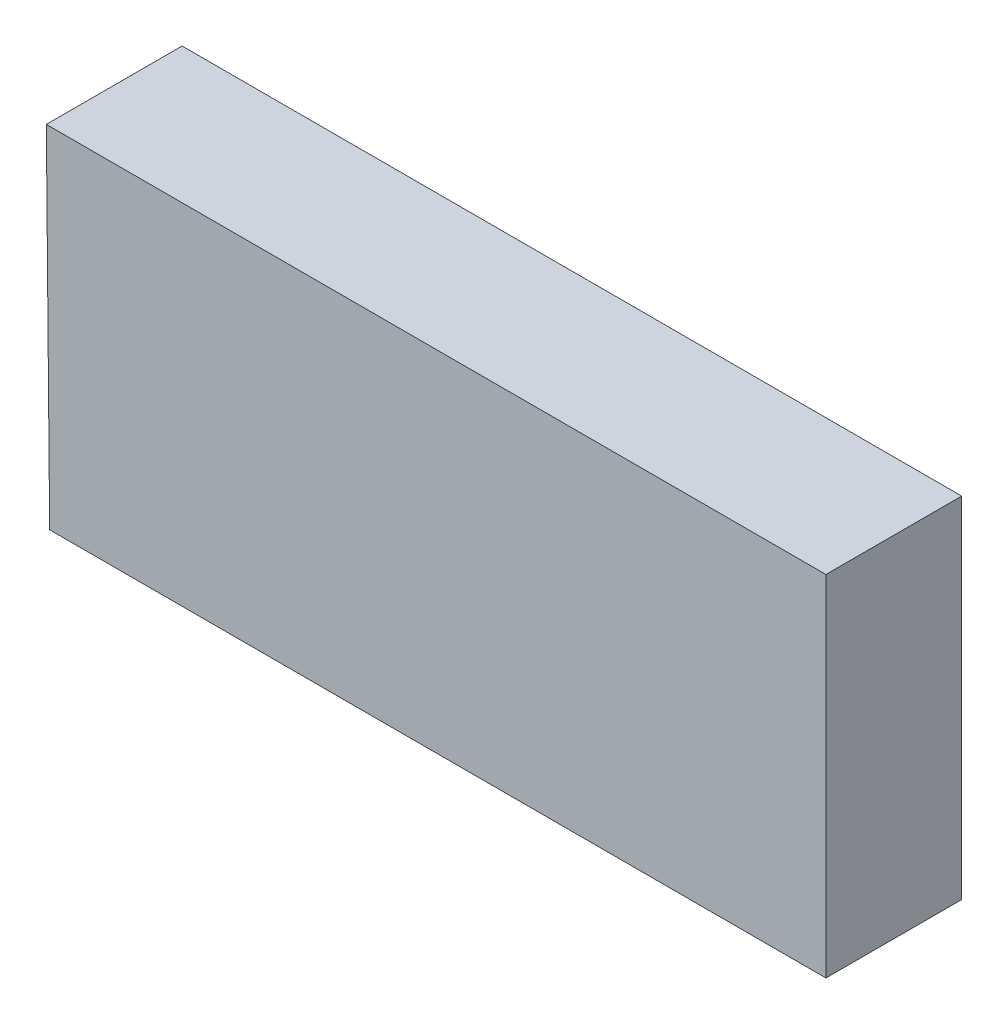
ISO-10303-21;
HEADER;
FILE_DESCRIPTION(('STEP AP214'),'2;1');
FILE_NAME('part.step','',(''),(''),'','','');
FILE_SCHEMA(('AUTOMOTIVE_DESIGN { 1 0 10303 214 1 1 1 1 }'));
ENDSEC;
DATA;
#1=APPLICATION_CONTEXT('core data for automotive mechanical design processes');
#2=APPLICATION_PROTOCOL_DEFINITION('international standard','automotive_design',2000,#1);
#3=PRODUCT_CONTEXT('',#1,'mechanical');
#4=PRODUCT('Part','Part','',(#3));
#5=PRODUCT_RELATED_PRODUCT_CATEGORY('part','',(#4));
#6=PRODUCT_DEFINITION_FORMATION('','',#4);
#7=PRODUCT_DEFINITION_CONTEXT('part definition',#1,'design');
#8=PRODUCT_DEFINITION('design','',#6,#7);
#9=PRODUCT_DEFINITION_SHAPE('','',#8);
#10=(LENGTH_UNIT() NAMED_UNIT(*) SI_UNIT(.MILLI.,.METRE.));
#11=(NAMED_UNIT(*) PLANE_ANGLE_UNIT() SI_UNIT($,.RADIAN.));
#12=(NAMED_UNIT(*) SI_UNIT($,.STERADIAN.) SOLID_ANGLE_UNIT());
#13=UNCERTAINTY_MEASURE_WITH_UNIT(LENGTH_MEASURE(1.E-05),#10,'distance_accuracy_value','');
#14=(GEOMETRIC_REPRESENTATION_CONTEXT(3) GLOBAL_UNCERTAINTY_ASSIGNED_CONTEXT((#13)) GLOBAL_UNIT_ASSIGNED_CONTEXT((#10,
#11,#12)) REPRESENTATION_CONTEXT('',''));
#15=CARTESIAN_POINT('',(0.,0.,0.));
#16=DIRECTION('',(0.,0.,1.));
#17=DIRECTION('',(1.,0.,0.));
#18=AXIS2_PLACEMENT_3D('',#15,#16,#17);
#19=CARTESIAN_POINT('',(-1.44999964,0.65000124,0.50499772));
#20=DIRECTION('',(0.,0.,1.));
#21=DIRECTION('',(1.,0.,0.));
#22=AXIS2_PLACEMENT_3D('',#19,#20,#21);
#23=PLANE('',#22);
#24=DIRECTION('',(1.,0.,0.));
#25=VECTOR('',#24,1.);
#26=CARTESIAN_POINT('',(-1.44999964,0.65000124,0.50499772));
#27=LINE('',#26,#25);
#28=CARTESIAN_POINT('',(-1.44999964,0.65000124,0.50499772));
#29=VERTEX_POINT('',#28);
#30=CARTESIAN_POINT('',(1.44999964,0.65000124,0.50499772));
#31=VERTEX_POINT('',#30);
#32=EDGE_CURVE('E91',#29,#31,#27,.T.);
#33=ORIENTED_EDGE('',*,*,#32,.F.);
#34=DIRECTION('',(-0.00953824344815175,0.999954509921288,0.));
#35=VECTOR('',#34,1.);
#36=CARTESIAN_POINT('',(-1.43759936,-0.6499987,0.50499772));
#37=LINE('',#36,#35);
#38=CARTESIAN_POINT('',(-1.43759936,-0.6499987,0.50499772));
#39=VERTEX_POINT('',#38);
#40=EDGE_CURVE('E28',#39,#29,#37,.T.);
#41=ORIENTED_EDGE('',*,*,#40,.F.);
#42=DIRECTION('',(-1.,0.,0.));
#43=VECTOR('',#42,1.);
#44=CARTESIAN_POINT('',(1.44999964,-0.6499987,0.50499772));
#45=LINE('',#44,#43);
#46=CARTESIAN_POINT('',(1.44999964,-0.6499987,0.50499772));
#47=VERTEX_POINT('',#46);
#48=EDGE_CURVE('E21',#47,#39,#45,.T.);
#49=ORIENTED_EDGE('',*,*,#48,.F.);
#50=DIRECTION('',(0.,-1.,0.));
#51=VECTOR('',#50,1.);
#52=CARTESIAN_POINT('',(1.44999964,0.65000124,0.50499772));
#53=LINE('',#52,#51);
#54=EDGE_CURVE('E88',#31,#47,#53,.T.);
#55=ORIENTED_EDGE('',*,*,#54,.F.);
#56=EDGE_LOOP('',(#33,#41,#49,#55));
#57=FACE_BOUND('',#56,.T.);
#58=ADVANCED_FACE('F17',(#57),#23,.T.);
#59=CARTESIAN_POINT('',(-1.44999964,0.65000124,0.));
#60=DIRECTION('',(0.,0.,1.));
#61=DIRECTION('',(1.,0.,0.));
#62=AXIS2_PLACEMENT_3D('',#59,#60,#61);
#63=PLANE('',#62);
#64=DIRECTION('',(1.,0.,0.));
#65=VECTOR('',#64,1.);
#66=CARTESIAN_POINT('',(-1.44999964,0.65000124,0.));
#67=LINE('',#66,#65);
#68=CARTESIAN_POINT('',(-1.44999964,0.65000124,0.));
#69=VERTEX_POINT('',#68);
#70=CARTESIAN_POINT('',(1.44999964,0.65000124,0.));
#71=VERTEX_POINT('',#70);
#72=EDGE_CURVE('E83',#69,#71,#67,.T.);
#73=ORIENTED_EDGE('',*,*,#72,.T.);
#74=DIRECTION('',(0.,-1.,0.));
#75=VECTOR('',#74,1.);
#76=CARTESIAN_POINT('',(1.44999964,0.65000124,0.));
#77=LINE('',#76,#75);
#78=CARTESIAN_POINT('',(1.44999964,-0.6499987,0.));
#79=VERTEX_POINT('',#78);
#80=EDGE_CURVE('E74',#71,#79,#77,.T.);
#81=ORIENTED_EDGE('',*,*,#80,.T.);
#82=DIRECTION('',(-1.,0.,0.));
#83=VECTOR('',#82,1.);
#84=CARTESIAN_POINT('',(1.44999964,-0.6499987,0.));
#85=LINE('',#84,#83);
#86=CARTESIAN_POINT('',(-1.43759936,-0.6499987,0.));
#87=VERTEX_POINT('',#86);
#88=EDGE_CURVE('E104',#79,#87,#85,.T.);
#89=ORIENTED_EDGE('',*,*,#88,.T.);
#90=DIRECTION('',(-0.00953824344815175,0.999954509921288,0.));
#91=VECTOR('',#90,1.);
#92=CARTESIAN_POINT('',(-1.43759936,-0.6499987,0.));
#93=LINE('',#92,#91);
#94=EDGE_CURVE('E11',#87,#69,#93,.T.);
#95=ORIENTED_EDGE('',*,*,#94,.T.);
#96=EDGE_LOOP('',(#73,#81,#89,#95));
#97=FACE_BOUND('',#96,.T.);
#98=ADVANCED_FACE('F84',(#97),#63,.F.);
#99=CARTESIAN_POINT('',(-1.43759936,-0.6499987,0.));
#100=DIRECTION('',(-0.999954509921288,-0.00953824344815175,0.));
#101=DIRECTION('',(-0.00953824344815175,0.999954509921288,0.));
#102=AXIS2_PLACEMENT_3D('',#99,#100,#101);
#103=PLANE('',#102);
#104=DIRECTION('',(0.,0.,1.));
#105=VECTOR('',#104,1.);
#106=CARTESIAN_POINT('',(-1.43759936,-0.6499987,0.));
#107=LINE('',#106,#105);
#108=EDGE_CURVE('E101',#87,#39,#107,.T.);
#109=ORIENTED_EDGE('',*,*,#108,.T.);
#110=ORIENTED_EDGE('',*,*,#40,.T.);
#111=DIRECTION('',(0.,0.,1.));
#112=VECTOR('',#111,1.);
#113=CARTESIAN_POINT('',(-1.44999964,0.65000124,0.));
#114=LINE('',#113,#112);
#115=EDGE_CURVE('E98',#69,#29,#114,.T.);
#116=ORIENTED_EDGE('',*,*,#115,.F.);
#117=ORIENTED_EDGE('',*,*,#94,.F.);
#118=EDGE_LOOP('',(#109,#110,#116,#117));
#119=FACE_BOUND('',#118,.T.);
#120=ADVANCED_FACE('F123',(#119),#103,.T.);
#121=CARTESIAN_POINT('',(1.44999964,-0.6499987,0.));
#122=DIRECTION('',(0.,-1.,0.));
#123=DIRECTION('',(0.,0.,-1.));
#124=AXIS2_PLACEMENT_3D('',#121,#122,#123);
#125=PLANE('',#124);
#126=DIRECTION('',(0.,0.,1.));
#127=VECTOR('',#126,1.);
#128=CARTESIAN_POINT('',(1.44999964,-0.6499987,0.));
#129=LINE('',#128,#127);
#130=EDGE_CURVE('E80',#79,#47,#129,.T.);
#131=ORIENTED_EDGE('',*,*,#130,.T.);
#132=ORIENTED_EDGE('',*,*,#48,.T.);
#133=ORIENTED_EDGE('',*,*,#108,.F.);
#134=ORIENTED_EDGE('',*,*,#88,.F.);
#135=EDGE_LOOP('',(#131,#132,#133,#134));
#136=FACE_BOUND('',#135,.T.);
#137=ADVANCED_FACE('F114',(#136),#125,.T.);
#138=CARTESIAN_POINT('',(1.44999964,0.65000124,0.));
#139=DIRECTION('',(1.,0.,0.));
#140=DIRECTION('',(0.,1.,0.));
#141=AXIS2_PLACEMENT_3D('',#138,#139,#140);
#142=PLANE('',#141);
#143=DIRECTION('',(0.,0.,1.));
#144=VECTOR('',#143,1.);
#145=CARTESIAN_POINT('',(1.44999964,0.65000124,0.));
#146=LINE('',#145,#144);
#147=EDGE_CURVE('E77',#71,#31,#146,.T.);
#148=ORIENTED_EDGE('',*,*,#147,.T.);
#149=ORIENTED_EDGE('',*,*,#54,.T.);
#150=ORIENTED_EDGE('',*,*,#130,.F.);
#151=ORIENTED_EDGE('',*,*,#80,.F.);
#152=EDGE_LOOP('',(#148,#149,#150,#151));
#153=FACE_BOUND('',#152,.T.);
#154=ADVANCED_FACE('F19',(#153),#142,.T.);
#155=CARTESIAN_POINT('',(-1.44999964,0.65000124,0.));
#156=DIRECTION('',(0.,1.,0.));
#157=DIRECTION('',(1.,0.,0.));
#158=AXIS2_PLACEMENT_3D('',#155,#156,#157);
#159=PLANE('',#158);
#160=ORIENTED_EDGE('',*,*,#115,.T.);
#161=ORIENTED_EDGE('',*,*,#32,.T.);
#162=ORIENTED_EDGE('',*,*,#147,.F.);
#163=ORIENTED_EDGE('',*,*,#72,.F.);
#164=EDGE_LOOP('',(#160,#161,#162,#163));
#165=FACE_BOUND('',#164,.T.);
#166=ADVANCED_FACE('F90',(#165),#159,.T.);
#167=CLOSED_SHELL('',(#58,#98,#120,#137,#154,#166));
#168=MANIFOLD_SOLID_BREP('B1',#167);
#169=ADVANCED_BREP_SHAPE_REPRESENTATION('',(#18,#168),#14);
#170=SHAPE_DEFINITION_REPRESENTATION(#9,#169);
ENDSEC;
END-ISO-10303-21;
